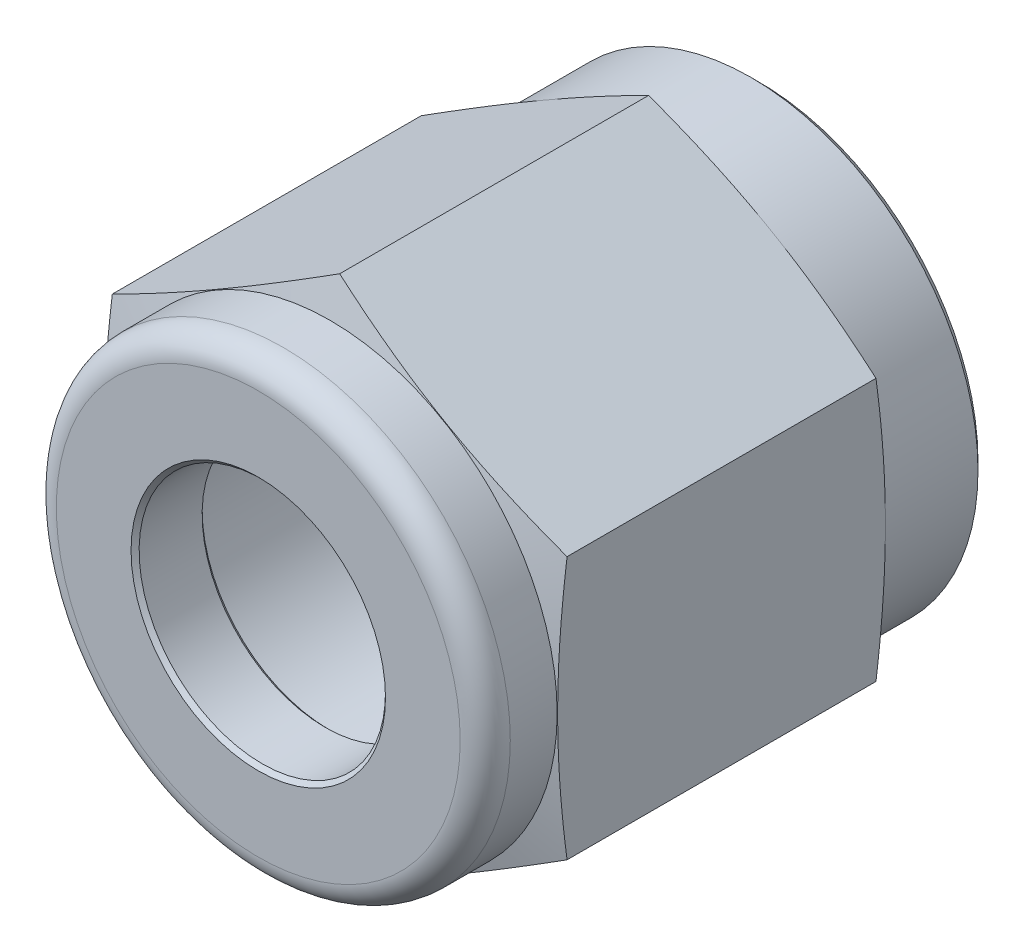
ISO-10303-21;
HEADER;
FILE_DESCRIPTION(('STEP AP214'),'2;1');
FILE_NAME('part.step','',(''),(''),'','','');
FILE_SCHEMA(('AUTOMOTIVE_DESIGN { 1 0 10303 214 1 1 1 1 }'));
ENDSEC;
DATA;
#1=APPLICATION_CONTEXT('core data for automotive mechanical design processes');
#2=APPLICATION_PROTOCOL_DEFINITION('international standard','automotive_design',2000,#1);
#3=PRODUCT_CONTEXT('',#1,'mechanical');
#4=PRODUCT('Part','Part','',(#3));
#5=PRODUCT_RELATED_PRODUCT_CATEGORY('part','',(#4));
#6=PRODUCT_DEFINITION_FORMATION('','',#4);
#7=PRODUCT_DEFINITION_CONTEXT('part definition',#1,'design');
#8=PRODUCT_DEFINITION('design','',#6,#7);
#9=PRODUCT_DEFINITION_SHAPE('','',#8);
#10=(LENGTH_UNIT() NAMED_UNIT(*) SI_UNIT(.MILLI.,.METRE.));
#11=(NAMED_UNIT(*) PLANE_ANGLE_UNIT() SI_UNIT($,.RADIAN.));
#12=(NAMED_UNIT(*) SI_UNIT($,.STERADIAN.) SOLID_ANGLE_UNIT());
#13=UNCERTAINTY_MEASURE_WITH_UNIT(LENGTH_MEASURE(1.E-05),#10,'distance_accuracy_value','');
#14=(GEOMETRIC_REPRESENTATION_CONTEXT(3) GLOBAL_UNCERTAINTY_ASSIGNED_CONTEXT((#13)) GLOBAL_UNIT_ASSIGNED_CONTEXT((#10,
#11,#12)) REPRESENTATION_CONTEXT('',''));
#15=CARTESIAN_POINT('',(0.,0.,0.));
#16=DIRECTION('',(0.,0.,1.));
#17=DIRECTION('',(1.,0.,0.));
#18=AXIS2_PLACEMENT_3D('',#15,#16,#17);
#19=CARTESIAN_POINT('',(0.,8.25622431946549,0.));
#20=DIRECTION('',(0.,0.,1.));
#21=DIRECTION('',(1.,0.,0.));
#22=AXIS2_PLACEMENT_3D('',#19,#20,#21);
#23=PLANE('',#22);
#24=CARTESIAN_POINT('',(0.,0.,0.));
#25=DIRECTION('',(0.,0.,1.));
#26=DIRECTION('',(1.,0.,0.));
#27=AXIS2_PLACEMENT_3D('',#24,#25,#26);
#28=CIRCLE('',#27,6.88339999999999);
#29=CARTESIAN_POINT('',(6.88339999999999,0.,0.));
#30=VERTEX_POINT('',#29);
#31=EDGE_CURVE('E273',#30,#30,#28,.F.);
#32=ORIENTED_EDGE('',*,*,#31,.T.);
#33=EDGE_LOOP('',(#32));
#34=FACE_BOUND('',#33,.T.);
#35=CARTESIAN_POINT('',(0.,0.,0.));
#36=DIRECTION('',(0.,0.,-1.));
#37=DIRECTION('',(0.,1.,0.));
#38=AXIS2_PLACEMENT_3D('',#35,#36,#37);
#39=CIRCLE('',#38,4.78291637771435);
#40=CARTESIAN_POINT('',(0.,4.78291637771435,0.));
#41=VERTEX_POINT('',#40);
#42=EDGE_CURVE('E242',#41,#41,#39,.T.);
#43=ORIENTED_EDGE('',*,*,#42,.F.);
#44=EDGE_LOOP('',(#43));
#45=FACE_BOUND('',#44,.T.);
#46=ADVANCED_FACE('F41',(#34,#45),#23,.F.);
#47=CARTESIAN_POINT('',(0.,0.,0.));
#48=DIRECTION('',(0.,0.,-1.));
#49=DIRECTION('',(0.,1.,0.));
#50=AXIS2_PLACEMENT_3D('',#47,#48,#49);
#51=CYLINDRICAL_SURFACE('',#50,7.1374);
#52=CARTESIAN_POINT('',(0.,0.,0.254000000000007));
#53=DIRECTION('',(0.,0.,1.));
#54=DIRECTION('',(0.,-1.,0.));
#55=AXIS2_PLACEMENT_3D('',#52,#53,#54);
#56=CIRCLE('',#55,7.1374);
#57=CARTESIAN_POINT('',(0.,-7.1374,0.254000000000006));
#58=VERTEX_POINT('',#57);
#59=EDGE_CURVE('E277',#58,#58,#56,.T.);
#60=ORIENTED_EDGE('',*,*,#59,.T.);
#61=EDGE_LOOP('',(#60));
#62=FACE_BOUND('',#61,.T.);
#63=CARTESIAN_POINT('',(0.,0.,3.175));
#64=DIRECTION('',(0.,0.,-1.));
#65=DIRECTION('',(0.,1.,0.));
#66=AXIS2_PLACEMENT_3D('',#63,#64,#65);
#67=CIRCLE('',#66,7.1374);
#68=CARTESIAN_POINT('',(0.,7.1374,3.175));
#69=VERTEX_POINT('',#68);
#70=EDGE_CURVE('E230',#69,#69,#67,.T.);
#71=ORIENTED_EDGE('',*,*,#70,.T.);
#72=EDGE_LOOP('',(#71));
#73=FACE_BOUND('',#72,.T.);
#74=ADVANCED_FACE('F141',(#62,#73),#51,.T.);
#75=CARTESIAN_POINT('',(0.,0.,3.47478807287307));
#76=DIRECTION('',(0.,0.,1.));
#77=DIRECTION('',(0.,-1.,0.));
#78=AXIS2_PLACEMENT_3D('',#75,#76,#77);
#79=CONICAL_SURFACE('',#78,8.25622431946549,1.30899693899575);
#80=ORIENTED_EDGE('',*,*,#70,.F.);
#81=EDGE_LOOP('',(#80));
#82=FACE_BOUND('',#81,.T.);
#83=CARTESIAN_POINT('',(7.1501,-10.9138828398678,4.75860151542387));
#84=CARTESIAN_POINT('',(7.1501,-10.5895769453141,4.68593353797852));
#85=CARTESIAN_POINT('',(7.1501,-10.2650680273871,4.61415538239005));
#86=CARTESIAN_POINT('',(7.1501,-9.61554445132473,4.47285900938083));
#87=CARTESIAN_POINT('',(7.1501,-9.29052977193818,4.40334088976508));
#88=CARTESIAN_POINT('',(7.1501,-8.63960294263009,4.26698420272897));
#89=CARTESIAN_POINT('',(7.1501,-8.31369022433024,4.20014833891397));
#90=CARTESIAN_POINT('',(7.1501,-7.66118595771361,4.06987862293135));
#91=CARTESIAN_POINT('',(7.1501,-7.33459441516394,4.00644474198301));
#92=CARTESIAN_POINT('',(7.1501,-6.68322136510452,3.88427824027479));
#93=CARTESIAN_POINT('',(7.1501,-6.3584461559822,3.82551220270828));
#94=CARTESIAN_POINT('',(7.1501,-5.70800949079891,3.71311782777684));
#95=CARTESIAN_POINT('',(7.1501,-5.38234805443124,3.65948937719041));
#96=CARTESIAN_POINT('',(7.1501,-4.73007647747673,3.55857904077149));
#97=CARTESIAN_POINT('',(7.1501,-4.40346646054479,3.51129636258905));
#98=CARTESIAN_POINT('',(7.1501,-3.74920730598459,3.42447209387384));
#99=CARTESIAN_POINT('',(7.1501,-3.42155816742004,3.38493051031814));
#100=CARTESIAN_POINT('',(7.1501,-2.76152687678763,3.31470950062921));
#101=CARTESIAN_POINT('',(7.1501,-2.42913328445532,3.28413600874202));
#102=CARTESIAN_POINT('',(7.1501,-1.76351186555912,3.23396118681777));
#103=CARTESIAN_POINT('',(7.1501,-1.43028405830245,3.21435960516025));
#104=CARTESIAN_POINT('',(7.1501,-0.763477429194141,3.18727191792475));
#105=CARTESIAN_POINT('',(7.1501,-0.429898834629788,3.17978032997945));
#106=CARTESIAN_POINT('',(7.1501,0.237304404669708,3.17737307413878));
#107=CARTESIAN_POINT('',(7.1501,0.570929049369216,3.1824573965662));
#108=CARTESIAN_POINT('',(7.1501,1.23897011925806,3.20491601919626));
#109=CARTESIAN_POINT('',(7.1501,1.57338501416503,3.22233492739003));
#110=CARTESIAN_POINT('',(7.1501,2.24142747986446,3.26846906294717));
#111=CARTESIAN_POINT('',(7.1501,2.57505503309474,3.29718453993661));
#112=CARTESIAN_POINT('',(7.1501,3.24152020478241,3.36446292134966));
#113=CARTESIAN_POINT('',(7.1501,3.57435716585659,3.40303223824729));
#114=CARTESIAN_POINT('',(7.1501,4.23896018219755,3.48841538968918));
#115=CARTESIAN_POINT('',(7.1501,4.5707262341084,3.53522925004388));
#116=CARTESIAN_POINT('',(7.1501,5.21100647270475,3.63223991881821));
#117=CARTESIAN_POINT('',(7.15009999999999,5.51958762732812,3.68199919010589));
#118=CARTESIAN_POINT('',(7.15009999999999,6.13593768218003,3.78633917810774));
#119=CARTESIAN_POINT('',(7.15009999999999,6.44370656011541,3.840920025763));
#120=CARTESIAN_POINT('',(7.15009999999999,7.05854436625168,3.95402195375594));
#121=CARTESIAN_POINT('',(7.15009999999999,7.36561322948537,4.0125433855596));
#122=CARTESIAN_POINT('',(7.15009999999999,7.97912096047287,4.13280787737556));
#123=CARTESIAN_POINT('',(7.15009999999999,8.28555982003552,4.19455097900331));
#124=CARTESIAN_POINT('',(7.15009999999999,9.20420130280969,4.38373831827979));
#125=CARTESIAN_POINT('',(7.15009999999999,9.8155932174319,4.51511507330491));
#126=CARTESIAN_POINT('',(7.15009999999999,11.0367521079976,4.78497858913828));
#127=CARTESIAN_POINT('',(7.15009999999999,11.6465191763972,4.923464935903));
#128=CARTESIAN_POINT('',(7.15009999999999,12.8589027680631,5.20406216254));
#129=CARTESIAN_POINT('',(7.15009999999999,13.4615306645536,5.3461240373558));
#130=CARTESIAN_POINT('',(7.15009999999999,14.6659456190864,5.63380550214537));
#131=CARTESIAN_POINT('',(7.15009999999999,15.2677326616641,5.77942515666527));
#132=CARTESIAN_POINT('',(7.15009999999999,16.4699234495495,6.07311302859643));
#133=CARTESIAN_POINT('',(7.15009999999999,17.0703279858856,6.22117801444107));
#134=CARTESIAN_POINT('',(7.15009999999999,18.2706138615976,6.51933121206419));
#135=CARTESIAN_POINT('',(7.15009999999999,18.8704952175481,6.66941935707092));
#136=CARTESIAN_POINT('',(7.15009999999999,19.4701941525164,6.82022419671362));
#137=B_SPLINE_CURVE_WITH_KNOTS('',3,(#83,#84,#85,#86,#87,#88,#89,#90,#91,#92,#93,#94,#95,#96,
#97,#98,#99,#100,#101,#102,#103,#104,#105,#106,#107,#108,#109,#110,#111,#112,#113,#114,#115,
#116,#117,#118,#119,#120,#121,#122,#123,#124,#125,#126,#127,#128,#129,#130,#131,#132,#133,#134,
#135,#136),.UNSPECIFIED.,.F.,.F.,(4,2,2,2,2,2,2,2,2,2,2,2,2,2,2,2,2,2,2,2,2,2,2,2,2,2,4),(0.,
0.997046960858289,1.99413701250312,2.9922080643413,3.99027067118493,4.98038490126997,
5.97047730631967,6.96044597056545,7.95041552706989,8.9516470921889,9.95285569497361,
10.9536109092371,11.9543653534154,12.9587576300209,13.9631721024439,14.9682418788671,
15.9733148018248,16.9109716545956,17.8486539794465,18.7864200485021,19.7241982340131,
21.6001685185764,23.4760296753264,25.3334528568964,27.1909097613661,29.0460823073238,
30.9011937748789),.UNSPECIFIED.);
#138=CARTESIAN_POINT('',(7.1501,-4.12811215973275,3.47478807287307));
#139=VERTEX_POINT('',#138);
#140=CARTESIAN_POINT('',(7.1501,4.12811215973275,3.47478807287307));
#141=VERTEX_POINT('',#140);
#142=EDGE_CURVE('E113',#139,#141,#137,.T.);
#143=ORIENTED_EDGE('',*,*,#142,.F.);
#144=CARTESIAN_POINT('',(-0.000199999999988828,-8.25633978951932,3.47481901362982));
#145=CARTESIAN_POINT('',(0.296742266660478,-8.08490009192912,3.42886257681858));
#146=CARTESIAN_POINT('',(0.594222923002725,-7.91314955491122,3.38714171766773));
#147=CARTESIAN_POINT('',(1.19023480972998,-7.56904193166902,3.31384208241379));
#148=CARTESIAN_POINT('',(1.48876641720988,-7.39668462772889,3.2822674258099));
#149=CARTESIAN_POINT('',(2.08507021110049,-7.05240847180735,3.23110350009016));
#150=CARTESIAN_POINT('',(2.38283836532122,-6.88049194781191,3.21145321592267));
#151=CARTESIAN_POINT('',(2.97875440278981,-6.536439663165,3.1851041961545));
#152=CARTESIAN_POINT('',(3.27690220139491,-6.36430395138206,3.17840295474387));
#153=CARTESIAN_POINT('',(3.8731977986051,-6.02003252781616,3.17840295474387));
#154=CARTESIAN_POINT('',(4.17134559721019,-5.84789681603322,3.1851041961545));
#155=CARTESIAN_POINT('',(4.76726163467879,-5.50384453138631,3.21145321592267));
#156=CARTESIAN_POINT('',(5.06502978889951,-5.33192800739088,3.23110350009016));
#157=CARTESIAN_POINT('',(5.66133358279013,-4.98765185146934,3.2822674258099));
#158=CARTESIAN_POINT('',(5.95986519027003,-4.8152945475292,3.31384208241379));
#159=CARTESIAN_POINT('',(6.55587707699728,-4.471186924287,3.38714171766773));
#160=CARTESIAN_POINT('',(6.85335773333953,-4.2994363872691,3.42886257681858));
#161=CARTESIAN_POINT('',(7.1503,-4.1279966896789,3.47481901362982));
#162=B_SPLINE_CURVE_WITH_KNOTS('',3,(#144,#145,#146,#147,#148,#149,#150,#151,#152,#153,#154,
#155,#156,#157,#158,#159,#160,#161),.UNSPECIFIED.,.F.,.F.,(4,2,2,2,2,2,2,2,4),(0.,
1.0378908111893,2.07620248958682,3.10915548710712,4.14190857462195,5.17466166213679,
6.20761465965709,7.24592633805461,8.28381714924391),.UNSPECIFIED.);
#163=CARTESIAN_POINT('',(0.,-8.25622431946549,3.47478807287307));
#164=VERTEX_POINT('',#163);
#165=EDGE_CURVE('E152',#164,#139,#162,.T.);
#166=ORIENTED_EDGE('',*,*,#165,.F.);
#167=CARTESIAN_POINT('',(-7.1503,-4.1279966896789,3.47481901362982));
#168=CARTESIAN_POINT('',(-6.85335773333953,-4.2994363872691,3.42886257681858));
#169=CARTESIAN_POINT('',(-6.55587707699728,-4.471186924287,3.38714171766773));
#170=CARTESIAN_POINT('',(-5.95986519027002,-4.8152945475292,3.31384208241379));
#171=CARTESIAN_POINT('',(-5.66133358279012,-4.98765185146934,3.2822674258099));
#172=CARTESIAN_POINT('',(-5.06502978889951,-5.33192800739088,3.23110350009016));
#173=CARTESIAN_POINT('',(-4.76726163467878,-5.50384453138631,3.21145321592267));
#174=CARTESIAN_POINT('',(-4.17134559721019,-5.84789681603322,3.1851041961545));
#175=CARTESIAN_POINT('',(-3.87319779860509,-6.02003252781616,3.17840295474387));
#176=CARTESIAN_POINT('',(-3.2769022013949,-6.36430395138206,3.17840295474387));
#177=CARTESIAN_POINT('',(-2.9787544027898,-6.536439663165,3.1851041961545));
#178=CARTESIAN_POINT('',(-2.3828383653212,-6.88049194781191,3.21145321592267));
#179=CARTESIAN_POINT('',(-2.08507021110048,-7.05240847180735,3.23110350009016));
#180=CARTESIAN_POINT('',(-1.48876641720987,-7.39668462772889,3.2822674258099));
#181=CARTESIAN_POINT('',(-1.19023480972996,-7.56904193166902,3.31384208241379));
#182=CARTESIAN_POINT('',(-0.594222923002706,-7.91314955491122,3.38714171766773));
#183=CARTESIAN_POINT('',(-0.296742266660458,-8.08490009192912,3.42886257681858));
#184=CARTESIAN_POINT('',(0.000200000000009483,-8.25633978951932,3.47481901362982));
#185=B_SPLINE_CURVE_WITH_KNOTS('',3,(#167,#168,#169,#170,#171,#172,#173,#174,#175,#176,#177,
#178,#179,#180,#181,#182,#183,#184),.UNSPECIFIED.,.F.,.F.,(4,2,2,2,2,2,2,2,4),(0.,
1.0378908111893,2.07620248958683,3.10915548710713,4.14190857462196,5.1746616621368,
6.2076146596571,7.24592633805462,8.28381714924392),.UNSPECIFIED.);
#186=CARTESIAN_POINT('',(-7.15010000000001,-4.12811215973273,3.47478807287307));
#187=VERTEX_POINT('',#186);
#188=EDGE_CURVE('E160',#187,#164,#185,.T.);
#189=ORIENTED_EDGE('',*,*,#188,.F.);
#190=CARTESIAN_POINT('',(-7.15009999999999,-10.9138828398678,4.75860151542387));
#191=CARTESIAN_POINT('',(-7.15009999999999,-10.5895769453141,4.68593353797852));
#192=CARTESIAN_POINT('',(-7.15009999999999,-10.2650680273871,4.61415538239005));
#193=CARTESIAN_POINT('',(-7.15009999999999,-9.61554445132474,4.47285900938083));
#194=CARTESIAN_POINT('',(-7.15009999999999,-9.29052977193818,4.40334088976508));
#195=CARTESIAN_POINT('',(-7.15009999999999,-8.63960294263009,4.26698420272897));
#196=CARTESIAN_POINT('',(-7.15009999999999,-8.31369022433025,4.20014833891397));
#197=CARTESIAN_POINT('',(-7.15009999999999,-7.66118595771361,4.06987862293135));
#198=CARTESIAN_POINT('',(-7.15009999999999,-7.33459441516395,4.00644474198301));
#199=CARTESIAN_POINT('',(-7.15009999999999,-6.68322136510452,3.88427824027479));
#200=CARTESIAN_POINT('',(-7.15009999999999,-6.3584461559822,3.82551220270828));
#201=CARTESIAN_POINT('',(-7.15009999999999,-5.70800949079891,3.71311782777684));
#202=CARTESIAN_POINT('',(-7.15009999999999,-5.38234805443124,3.65948937719041));
#203=CARTESIAN_POINT('',(-7.15009999999999,-4.73007647747673,3.55857904077149));
#204=CARTESIAN_POINT('',(-7.1501,-4.40346646054479,3.51129636258905));
#205=CARTESIAN_POINT('',(-7.1501,-3.7492073059846,3.42447209387384));
#206=CARTESIAN_POINT('',(-7.1501,-3.42155816742005,3.38493051031814));
#207=CARTESIAN_POINT('',(-7.1501,-2.76152687678764,3.31470950062921));
#208=CARTESIAN_POINT('',(-7.1501,-2.42913328445533,3.28413600874202));
#209=CARTESIAN_POINT('',(-7.1501,-1.76351186555912,3.23396118681777));
#210=CARTESIAN_POINT('',(-7.1501,-1.43028405830246,3.21435960516025));
#211=CARTESIAN_POINT('',(-7.1501,-0.763477429194147,3.18727191792475));
#212=CARTESIAN_POINT('',(-7.1501,-0.429898834629794,3.17978032997945));
#213=CARTESIAN_POINT('',(-7.1501,0.237304404669702,3.17737307413878));
#214=CARTESIAN_POINT('',(-7.1501,0.57092904936921,3.1824573965662));
#215=CARTESIAN_POINT('',(-7.1501,1.23897011925806,3.20491601919626));
#216=CARTESIAN_POINT('',(-7.1501,1.57338501416502,3.22233492739003));
#217=CARTESIAN_POINT('',(-7.1501,2.24142747986446,3.26846906294717));
#218=CARTESIAN_POINT('',(-7.1501,2.57505503309474,3.29718453993661));
#219=CARTESIAN_POINT('',(-7.1501,3.2415202047824,3.36446292134967));
#220=CARTESIAN_POINT('',(-7.1501,3.57435716585659,3.40303223824729));
#221=CARTESIAN_POINT('',(-7.1501,4.23896018219754,3.48841538968918));
#222=CARTESIAN_POINT('',(-7.1501,4.5707262341084,3.53522925004388));
#223=CARTESIAN_POINT('',(-7.1501,5.21100647270474,3.63223991881821));
#224=CARTESIAN_POINT('',(-7.1501,5.51958762732811,3.68199919010589));
#225=CARTESIAN_POINT('',(-7.1501,6.13593768218002,3.78633917810774));
#226=CARTESIAN_POINT('',(-7.15010000000001,6.4437065601154,3.840920025763));
#227=CARTESIAN_POINT('',(-7.15010000000001,7.05854436625167,3.95402195375594));
#228=CARTESIAN_POINT('',(-7.15010000000001,7.36561322948536,4.0125433855596));
#229=CARTESIAN_POINT('',(-7.15010000000001,7.97912096047286,4.13280787737556));
#230=CARTESIAN_POINT('',(-7.15010000000001,8.28555982003552,4.19455097900331));
#231=CARTESIAN_POINT('',(-7.15010000000001,9.20420130280969,4.38373831827979));
#232=CARTESIAN_POINT('',(-7.15010000000001,9.81559321743189,4.51511507330491));
#233=CARTESIAN_POINT('',(-7.15010000000001,11.0367521079976,4.78497858913828));
#234=CARTESIAN_POINT('',(-7.15010000000001,11.6465191763972,4.923464935903));
#235=CARTESIAN_POINT('',(-7.15010000000001,12.8589027680631,5.20406216254));
#236=CARTESIAN_POINT('',(-7.15010000000001,13.4615306645536,5.3461240373558));
#237=CARTESIAN_POINT('',(-7.15010000000001,14.6659456190864,5.63380550214537));
#238=CARTESIAN_POINT('',(-7.15010000000001,15.267732661664,5.77942515666527));
#239=CARTESIAN_POINT('',(-7.15010000000001,16.4699234495495,6.07311302859643));
#240=CARTESIAN_POINT('',(-7.15010000000001,17.0703279858856,6.22117801444107));
#241=CARTESIAN_POINT('',(-7.15010000000002,18.2706138615976,6.51933121206419));
#242=CARTESIAN_POINT('',(-7.15010000000002,18.8704952175481,6.66941935707092));
#243=CARTESIAN_POINT('',(-7.15010000000002,19.4701941525164,6.82022419671361));
#244=B_SPLINE_CURVE_WITH_KNOTS('',3,(#190,#191,#192,#193,#194,#195,#196,#197,#198,#199,#200,
#201,#202,#203,#204,#205,#206,#207,#208,#209,#210,#211,#212,#213,#214,#215,#216,#217,#218,#219,
#220,#221,#222,#223,#224,#225,#226,#227,#228,#229,#230,#231,#232,#233,#234,#235,#236,#237,#238,
#239,#240,#241,#242,#243),.UNSPECIFIED.,.F.,.F.,(4,2,2,2,2,2,2,2,2,2,2,2,2,2,2,2,2,2,2,2,2,2,2,
2,2,2,4),(0.,0.997046960858289,1.99413701250312,2.9922080643413,3.99027067118493,
4.98038490126997,5.97047730631967,6.96044597056545,7.95041552706989,8.9516470921889,
9.95285569497361,10.9536109092371,11.9543653534154,12.9587576300209,13.9631721024439,
14.9682418788671,15.9733148018248,16.9109716545956,17.8486539794465,18.7864200485021,
19.7241982340131,21.6001685185764,23.4760296753264,25.3334528568964,27.1909097613661,
29.0460823073238,30.9011937748789),.UNSPECIFIED.);
#245=CARTESIAN_POINT('',(-7.1501,4.12811215973274,3.47478807287307));
#246=VERTEX_POINT('',#245);
#247=EDGE_CURVE('E95',#246,#187,#244,.F.);
#248=ORIENTED_EDGE('',*,*,#247,.F.);
#249=CARTESIAN_POINT('',(0.000200000000000074,8.25633978951933,3.47481901362982));
#250=CARTESIAN_POINT('',(-0.296742266660467,8.08490009192913,3.42886257681859));
#251=CARTESIAN_POINT('',(-0.594222923002715,7.91314955491122,3.38714171766774));
#252=CARTESIAN_POINT('',(-1.19023480972997,7.56904193166902,3.31384208241379));
#253=CARTESIAN_POINT('',(-1.48876641720987,7.39668462772889,3.2822674258099));
#254=CARTESIAN_POINT('',(-2.08507021110049,7.05240847180735,3.23110350009017));
#255=CARTESIAN_POINT('',(-2.38283836532121,6.88049194781192,3.21145321592267));
#256=CARTESIAN_POINT('',(-2.97875440278981,6.53643966316501,3.1851041961545));
#257=CARTESIAN_POINT('',(-3.2769022013949,6.36430395138206,3.17840295474388));
#258=CARTESIAN_POINT('',(-3.8731977986051,6.02003252781617,3.17840295474388));
#259=CARTESIAN_POINT('',(-4.17134559721019,5.84789681603322,3.1851041961545));
#260=CARTESIAN_POINT('',(-4.76726163467879,5.50384453138631,3.21145321592267));
#261=CARTESIAN_POINT('',(-5.06502978889952,5.33192800739088,3.23110350009017));
#262=CARTESIAN_POINT('',(-5.66133358279013,4.98765185146934,3.2822674258099));
#263=CARTESIAN_POINT('',(-5.95986519027003,4.81529454752921,3.31384208241379));
#264=CARTESIAN_POINT('',(-6.55587707699729,4.47118692428701,3.38714171766774));
#265=CARTESIAN_POINT('',(-6.85335773333953,4.2994363872691,3.42886257681859));
#266=CARTESIAN_POINT('',(-7.1503,4.12799668967891,3.47481901362982));
#267=B_SPLINE_CURVE_WITH_KNOTS('',3,(#249,#250,#251,#252,#253,#254,#255,#256,#257,#258,#259,
#260,#261,#262,#263,#264,#265,#266),.UNSPECIFIED.,.F.,.F.,(4,2,2,2,2,2,2,2,4),(0.,
1.0378908111893,2.07620248958682,3.10915548710713,4.14190857462196,5.1746616621368,
6.2076146596571,7.24592633805462,8.28381714924392),.UNSPECIFIED.);
#268=CARTESIAN_POINT('',(0.,8.25622431946549,3.47478807287307));
#269=VERTEX_POINT('',#268);
#270=EDGE_CURVE('E92',#269,#246,#267,.T.);
#271=ORIENTED_EDGE('',*,*,#270,.F.);
#272=CARTESIAN_POINT('',(7.1503,4.12799668967892,3.47481901362982));
#273=CARTESIAN_POINT('',(6.85335773333953,4.29943638726911,3.42886257681859));
#274=CARTESIAN_POINT('',(6.55587707699728,4.47118692428702,3.38714171766774));
#275=CARTESIAN_POINT('',(5.95986519027002,4.81529454752921,3.31384208241379));
#276=CARTESIAN_POINT('',(5.66133358279012,4.98765185146935,3.2822674258099));
#277=CARTESIAN_POINT('',(5.06502978889951,5.33192800739089,3.23110350009017));
#278=CARTESIAN_POINT('',(4.76726163467879,5.50384453138632,3.21145321592267));
#279=CARTESIAN_POINT('',(4.17134559721019,5.84789681603323,3.1851041961545));
#280=CARTESIAN_POINT('',(3.87319779860509,6.02003252781618,3.17840295474388));
#281=CARTESIAN_POINT('',(3.2769022013949,6.36430395138207,3.17840295474388));
#282=CARTESIAN_POINT('',(2.97875440278981,6.53643966316501,3.1851041961545));
#283=CARTESIAN_POINT('',(2.38283836532121,6.88049194781192,3.21145321592267));
#284=CARTESIAN_POINT('',(2.08507021110049,7.05240847180736,3.23110350009017));
#285=CARTESIAN_POINT('',(1.48876641720987,7.39668462772889,3.2822674258099));
#286=CARTESIAN_POINT('',(1.19023480972997,7.56904193166903,3.31384208241379));
#287=CARTESIAN_POINT('',(0.594222923002716,7.91314955491122,3.38714171766774));
#288=CARTESIAN_POINT('',(0.296742266660468,8.08490009192913,3.42886257681859));
#289=CARTESIAN_POINT('',(-0.000199999999998477,8.25633978951933,3.47481901362982));
#290=B_SPLINE_CURVE_WITH_KNOTS('',3,(#272,#273,#274,#275,#276,#277,#278,#279,#280,#281,#282,
#283,#284,#285,#286,#287,#288,#289),.UNSPECIFIED.,.F.,.F.,(4,2,2,2,2,2,2,2,4),(0.,
1.0378908111893,2.07620248958682,3.10915548710712,4.14190857462196,5.17466166213679,
6.20761465965709,7.24592633805461,8.28381714924391),.UNSPECIFIED.);
#291=EDGE_CURVE('E64',#141,#269,#290,.T.);
#292=ORIENTED_EDGE('',*,*,#291,.F.);
#293=EDGE_LOOP('',(#143,#166,#189,#248,#271,#292));
#294=FACE_BOUND('',#293,.T.);
#295=ADVANCED_FACE('F93',(#82,#294),#79,.T.);
#296=CARTESIAN_POINT('',(7.1501,4.12811215973275,15.748));
#297=DIRECTION('',(-0.499999999999999,-0.866025403784439,0.));
#298=DIRECTION('',(0.866025403784439,-0.499999999999999,0.));
#299=AXIS2_PLACEMENT_3D('',#296,#297,#298);
#300=PLANE('',#299);
#301=DIRECTION('',(0.,0.,-1.));
#302=VECTOR('',#301,1.);
#303=CARTESIAN_POINT('',(0.,8.25622431946549,15.748));
#304=LINE('',#303,#302);
#305=CARTESIAN_POINT('',(0.,8.25622431946549,13.1876119271269));
#306=VERTEX_POINT('',#305);
#307=EDGE_CURVE('E106',#306,#269,#304,.T.);
#308=ORIENTED_EDGE('',*,*,#307,.F.);
#309=CARTESIAN_POINT('',(-0.0002,8.25633978951933,13.1875809863702));
#310=CARTESIAN_POINT('',(0.296742266660467,8.08490009192913,13.2335374231814));
#311=CARTESIAN_POINT('',(0.594222923002715,7.91314955491123,13.2752582823323));
#312=CARTESIAN_POINT('',(1.19023480972997,7.56904193166903,13.3485579175862));
#313=CARTESIAN_POINT('',(1.48876641720987,7.39668462772889,13.3801325741901));
#314=CARTESIAN_POINT('',(2.08507021110048,7.05240847180735,13.4312964999098));
#315=CARTESIAN_POINT('',(2.38283836532121,6.88049194781192,13.4509467840773));
#316=CARTESIAN_POINT('',(2.97875440278981,6.53643966316501,13.4772958038455));
#317=CARTESIAN_POINT('',(3.2769022013949,6.36430395138207,13.4839970452561));
#318=CARTESIAN_POINT('',(3.87319779860509,6.02003252781618,13.4839970452561));
#319=CARTESIAN_POINT('',(4.17134559721019,5.84789681603323,13.4772958038455));
#320=CARTESIAN_POINT('',(4.76726163467879,5.50384453138632,13.4509467840773));
#321=CARTESIAN_POINT('',(5.06502978889951,5.33192800739089,13.4312964999098));
#322=CARTESIAN_POINT('',(5.66133358279012,4.98765185146935,13.3801325741901));
#323=CARTESIAN_POINT('',(5.95986519027002,4.81529454752921,13.3485579175862));
#324=CARTESIAN_POINT('',(6.55587707699728,4.47118692428702,13.2752582823323));
#325=CARTESIAN_POINT('',(6.85335773333953,4.29943638726911,13.2335374231814));
#326=CARTESIAN_POINT('',(7.1503,4.12799668967892,13.1875809863702));
#327=B_SPLINE_CURVE_WITH_KNOTS('',3,(#309,#310,#311,#312,#313,#314,#315,#316,#317,#318,#319,
#320,#321,#322,#323,#324,#325,#326),.UNSPECIFIED.,.F.,.F.,(4,2,2,2,2,2,2,2,4),(0.,
1.0378908111893,2.07620248958682,3.10915548710712,4.14190857462196,5.17466166213679,
6.20761465965709,7.24592633805462,8.28381714924391),.UNSPECIFIED.);
#328=CARTESIAN_POINT('',(7.1501,4.12811215973275,13.1876119271269));
#329=VERTEX_POINT('',#328);
#330=EDGE_CURVE('E197',#306,#329,#327,.T.);
#331=ORIENTED_EDGE('',*,*,#330,.T.);
#332=DIRECTION('',(0.,0.,-1.));
#333=VECTOR('',#332,1.);
#334=CARTESIAN_POINT('',(7.1501,4.12811215973275,15.748));
#335=LINE('',#334,#333);
#336=EDGE_CURVE('E108',#329,#141,#335,.T.);
#337=ORIENTED_EDGE('',*,*,#336,.T.);
#338=ORIENTED_EDGE('',*,*,#291,.T.);
#339=EDGE_LOOP('',(#308,#331,#337,#338));
#340=FACE_BOUND('',#339,.T.);
#341=ADVANCED_FACE('F104',(#340),#300,.F.);
#342=CARTESIAN_POINT('',(0.,8.25622431946549,15.748));
#343=DIRECTION('',(0.5,-0.866025403784439,0.));
#344=DIRECTION('',(0.866025403784439,0.5,0.));
#345=AXIS2_PLACEMENT_3D('',#342,#343,#344);
#346=PLANE('',#345);
#347=DIRECTION('',(0.,0.,-1.));
#348=VECTOR('',#347,1.);
#349=CARTESIAN_POINT('',(-7.1501,4.12811215973274,15.748));
#350=LINE('',#349,#348);
#351=CARTESIAN_POINT('',(-7.1501,4.12811215973274,13.1876119271269));
#352=VERTEX_POINT('',#351);
#353=EDGE_CURVE('E114',#352,#246,#350,.T.);
#354=ORIENTED_EDGE('',*,*,#353,.F.);
#355=CARTESIAN_POINT('',(-7.1503,4.12799668967891,13.1875809863702));
#356=CARTESIAN_POINT('',(-6.85335773333954,4.2994363872691,13.2335374231814));
#357=CARTESIAN_POINT('',(-6.55587707699729,4.47118692428701,13.2752582823323));
#358=CARTESIAN_POINT('',(-5.95986519027003,4.81529454752921,13.3485579175862));
#359=CARTESIAN_POINT('',(-5.66133358279013,4.98765185146934,13.3801325741901));
#360=CARTESIAN_POINT('',(-5.06502978889952,5.33192800739088,13.4312964999098));
#361=CARTESIAN_POINT('',(-4.76726163467879,5.50384453138631,13.4509467840773));
#362=CARTESIAN_POINT('',(-4.17134559721019,5.84789681603322,13.4772958038455));
#363=CARTESIAN_POINT('',(-3.8731977986051,6.02003252781617,13.4839970452561));
#364=CARTESIAN_POINT('',(-3.27690220139491,6.36430395138206,13.4839970452561));
#365=CARTESIAN_POINT('',(-2.97875440278981,6.53643966316501,13.4772958038455));
#366=CARTESIAN_POINT('',(-2.38283836532121,6.88049194781192,13.4509467840773));
#367=CARTESIAN_POINT('',(-2.08507021110049,7.05240847180735,13.4312964999098));
#368=CARTESIAN_POINT('',(-1.48876641720988,7.39668462772889,13.3801325741901));
#369=CARTESIAN_POINT('',(-1.19023480972997,7.56904193166902,13.3485579175862));
#370=CARTESIAN_POINT('',(-0.594222923002716,7.91314955491122,13.2752582823323));
#371=CARTESIAN_POINT('',(-0.296742266660468,8.08490009192913,13.2335374231814));
#372=CARTESIAN_POINT('',(0.000199999999999177,8.25633978951933,13.1875809863702));
#373=B_SPLINE_CURVE_WITH_KNOTS('',3,(#355,#356,#357,#358,#359,#360,#361,#362,#363,#364,#365,
#366,#367,#368,#369,#370,#371,#372),.UNSPECIFIED.,.F.,.F.,(4,2,2,2,2,2,2,2,4),(0.,
1.0378908111893,2.07620248958682,3.10915548710713,4.14190857462196,5.1746616621368,
6.2076146596571,7.24592633805462,8.28381714924392),.UNSPECIFIED.);
#374=EDGE_CURVE('E112',#352,#306,#373,.T.);
#375=ORIENTED_EDGE('',*,*,#374,.T.);
#376=ORIENTED_EDGE('',*,*,#307,.T.);
#377=ORIENTED_EDGE('',*,*,#270,.T.);
#378=EDGE_LOOP('',(#354,#375,#376,#377));
#379=FACE_BOUND('',#378,.T.);
#380=ADVANCED_FACE('F111',(#379),#346,.F.);
#381=CARTESIAN_POINT('',(-7.1501,4.12811215973274,15.748));
#382=DIRECTION('',(1.,0.,0.));
#383=DIRECTION('',(0.,1.,0.));
#384=AXIS2_PLACEMENT_3D('',#381,#382,#383);
#385=PLANE('',#384);
#386=DIRECTION('',(0.,0.,-1.));
#387=VECTOR('',#386,1.);
#388=CARTESIAN_POINT('',(-7.1501,-4.12811215973274,15.748));
#389=LINE('',#388,#387);
#390=CARTESIAN_POINT('',(-7.15010000000001,-4.12811215973274,13.1876119271269));
#391=VERTEX_POINT('',#390);
#392=EDGE_CURVE('E118',#391,#187,#389,.T.);
#393=ORIENTED_EDGE('',*,*,#392,.F.);
#394=CARTESIAN_POINT('',(-7.15009999999999,-10.9138828398678,11.9037984845761));
#395=CARTESIAN_POINT('',(-7.15009999999999,-10.5895769453141,11.9764664620215));
#396=CARTESIAN_POINT('',(-7.15009999999999,-10.2650680273871,12.0482446176099));
#397=CARTESIAN_POINT('',(-7.15009999999999,-9.61554445132474,12.1895409906192));
#398=CARTESIAN_POINT('',(-7.15009999999999,-9.29052977193818,12.2590591102349));
#399=CARTESIAN_POINT('',(-7.15009999999999,-8.63960294263009,12.395415797271));
#400=CARTESIAN_POINT('',(-7.15009999999999,-8.31369022433025,12.462251661086));
#401=CARTESIAN_POINT('',(-7.15009999999999,-7.66118595771361,12.5925213770686));
#402=CARTESIAN_POINT('',(-7.15009999999999,-7.33459441516395,12.655955258017));
#403=CARTESIAN_POINT('',(-7.15009999999999,-6.68322136510452,12.7781217597252));
#404=CARTESIAN_POINT('',(-7.15009999999999,-6.3584461559822,12.8368877972917));
#405=CARTESIAN_POINT('',(-7.15009999999999,-5.70800949079891,12.9492821722232));
#406=CARTESIAN_POINT('',(-7.15009999999999,-5.38234805443124,13.0029106228096));
#407=CARTESIAN_POINT('',(-7.15009999999999,-4.73007647747673,13.1038209592285));
#408=CARTESIAN_POINT('',(-7.1501,-4.40346646054479,13.1511036374109));
#409=CARTESIAN_POINT('',(-7.1501,-3.7492073059846,13.2379279061262));
#410=CARTESIAN_POINT('',(-7.1501,-3.42155816742005,13.2774694896819));
#411=CARTESIAN_POINT('',(-7.1501,-2.76152687678764,13.3476904993708));
#412=CARTESIAN_POINT('',(-7.1501,-2.42913328445533,13.378263991258));
#413=CARTESIAN_POINT('',(-7.1501,-1.76351186555912,13.4284388131822));
#414=CARTESIAN_POINT('',(-7.1501,-1.43028405830246,13.4480403948397));
#415=CARTESIAN_POINT('',(-7.1501,-0.763477429194146,13.4751280820752));
#416=CARTESIAN_POINT('',(-7.1501,-0.429898834629792,13.4826196700206));
#417=CARTESIAN_POINT('',(-7.1501,0.237304404669703,13.4850269258612));
#418=CARTESIAN_POINT('',(-7.1501,0.570929049369213,13.4799426034338));
#419=CARTESIAN_POINT('',(-7.1501,1.23897011925806,13.4574839808037));
#420=CARTESIAN_POINT('',(-7.1501,1.57338501416502,13.44006507261));
#421=CARTESIAN_POINT('',(-7.1501,2.24142747986446,13.3939309370528));
#422=CARTESIAN_POINT('',(-7.1501,2.57505503309474,13.3652154600634));
#423=CARTESIAN_POINT('',(-7.1501,3.2415202047824,13.2979370786503));
#424=CARTESIAN_POINT('',(-7.1501,3.57435716585659,13.2593677617527));
#425=CARTESIAN_POINT('',(-7.1501,4.23896018219754,13.1739846103108));
#426=CARTESIAN_POINT('',(-7.1501,4.5707262341084,13.1271707499561));
#427=CARTESIAN_POINT('',(-7.1501,5.21100647270475,13.0301600811818));
#428=CARTESIAN_POINT('',(-7.1501,5.51958762732812,12.9804008098941));
#429=CARTESIAN_POINT('',(-7.1501,6.13593768218003,12.8760608218923));
#430=CARTESIAN_POINT('',(-7.15010000000001,6.44370656011541,12.821479974237));
#431=CARTESIAN_POINT('',(-7.15010000000001,7.05854436625168,12.7083780462441));
#432=CARTESIAN_POINT('',(-7.15010000000001,7.36561322948537,12.6498566144404));
#433=CARTESIAN_POINT('',(-7.15010000000001,7.97912096047287,12.5295921226244));
#434=CARTESIAN_POINT('',(-7.15010000000001,8.28555982003552,12.4678490209967));
#435=CARTESIAN_POINT('',(-7.15010000000001,9.20420130280969,12.2786616817202));
#436=CARTESIAN_POINT('',(-7.15010000000001,9.8155932174319,12.1472849266951));
#437=CARTESIAN_POINT('',(-7.15010000000001,11.0367521079976,11.8774214108617));
#438=CARTESIAN_POINT('',(-7.15010000000001,11.6465191763972,11.738935064097));
#439=CARTESIAN_POINT('',(-7.15010000000001,12.8589027680631,11.45833783746));
#440=CARTESIAN_POINT('',(-7.15010000000001,13.4615306645536,11.3162759626442));
#441=CARTESIAN_POINT('',(-7.15010000000001,14.6659456190864,11.0285944978546));
#442=CARTESIAN_POINT('',(-7.15010000000001,15.267732661664,10.8829748433347));
#443=CARTESIAN_POINT('',(-7.15010000000001,16.4699234495495,10.5892869714036));
#444=CARTESIAN_POINT('',(-7.15010000000001,17.0703279858856,10.4412219855589));
#445=CARTESIAN_POINT('',(-7.15010000000002,18.2706138615976,10.1430687879358));
#446=CARTESIAN_POINT('',(-7.15010000000002,18.8704952175481,9.99298064292908));
#447=CARTESIAN_POINT('',(-7.15010000000002,19.4701941525164,9.84217580328638));
#448=B_SPLINE_CURVE_WITH_KNOTS('',3,(#394,#395,#396,#397,#398,#399,#400,#401,#402,#403,#404,
#405,#406,#407,#408,#409,#410,#411,#412,#413,#414,#415,#416,#417,#418,#419,#420,#421,#422,#423,
#424,#425,#426,#427,#428,#429,#430,#431,#432,#433,#434,#435,#436,#437,#438,#439,#440,#441,#442,
#443,#444,#445,#446,#447),.UNSPECIFIED.,.F.,.F.,(4,2,2,2,2,2,2,2,2,2,2,2,2,2,2,2,2,2,2,2,2,2,2,
2,2,2,4),(0.,0.997046960858291,1.99413701250312,2.9922080643413,3.99027067118493,
4.98038490126997,5.97047730631967,6.96044597056546,7.95041552706989,8.9516470921889,
9.95285569497362,10.9536109092371,11.9543653534154,12.9587576300209,13.9631721024439,
14.9682418788671,15.9733148018248,16.9109716545956,17.8486539794465,18.7864200485021,
19.7241982340131,21.6001685185764,23.4760296753264,25.3334528568964,27.1909097613661,
29.0460823073238,30.9011937748789),.UNSPECIFIED.);
#449=EDGE_CURVE('E198',#391,#352,#448,.T.);
#450=ORIENTED_EDGE('',*,*,#449,.T.);
#451=ORIENTED_EDGE('',*,*,#353,.T.);
#452=ORIENTED_EDGE('',*,*,#247,.T.);
#453=EDGE_LOOP('',(#393,#450,#451,#452));
#454=FACE_BOUND('',#453,.T.);
#455=ADVANCED_FACE('F185',(#454),#385,.F.);
#456=CARTESIAN_POINT('',(-7.1501,-4.12811215973274,15.748));
#457=DIRECTION('',(0.5,0.866025403784439,0.));
#458=DIRECTION('',(-0.866025403784439,0.499999999999999,0.));
#459=AXIS2_PLACEMENT_3D('',#456,#457,#458);
#460=PLANE('',#459);
#461=DIRECTION('',(0.,0.,-1.));
#462=VECTOR('',#461,1.);
#463=CARTESIAN_POINT('',(0.,-8.25622431946548,15.748));
#464=LINE('',#463,#462);
#465=CARTESIAN_POINT('',(0.,-8.25622431946549,13.1876119271269));
#466=VERTEX_POINT('',#465);
#467=EDGE_CURVE('E213',#466,#164,#464,.T.);
#468=ORIENTED_EDGE('',*,*,#467,.F.);
#469=CARTESIAN_POINT('',(0.000200000000011247,-8.25633978951932,13.1875809863702));
#470=CARTESIAN_POINT('',(-0.296742266660456,-8.08490009192912,13.2335374231814));
#471=CARTESIAN_POINT('',(-0.594222923002704,-7.91314955491122,13.2752582823323));
#472=CARTESIAN_POINT('',(-1.19023480972996,-7.56904193166902,13.3485579175862));
#473=CARTESIAN_POINT('',(-1.48876641720986,-7.39668462772889,13.3801325741901));
#474=CARTESIAN_POINT('',(-2.08507021110048,-7.05240847180735,13.4312964999098));
#475=CARTESIAN_POINT('',(-2.3828383653212,-6.88049194781191,13.4509467840773));
#476=CARTESIAN_POINT('',(-2.9787544027898,-6.536439663165,13.4772958038455));
#477=CARTESIAN_POINT('',(-3.2769022013949,-6.36430395138206,13.4839970452561));
#478=CARTESIAN_POINT('',(-3.87319779860509,-6.02003252781616,13.4839970452561));
#479=CARTESIAN_POINT('',(-4.17134559721018,-5.84789681603322,13.4772958038455));
#480=CARTESIAN_POINT('',(-4.76726163467878,-5.50384453138631,13.4509467840773));
#481=CARTESIAN_POINT('',(-5.06502978889951,-5.33192800739088,13.4312964999098));
#482=CARTESIAN_POINT('',(-5.66133358279012,-4.98765185146934,13.3801325741901));
#483=CARTESIAN_POINT('',(-5.95986519027002,-4.8152945475292,13.3485579175862));
#484=CARTESIAN_POINT('',(-6.55587707699728,-4.471186924287,13.2752582823323));
#485=CARTESIAN_POINT('',(-6.85335773333953,-4.2994363872691,13.2335374231814));
#486=CARTESIAN_POINT('',(-7.1503,-4.1279966896789,13.1875809863702));
#487=B_SPLINE_CURVE_WITH_KNOTS('',3,(#469,#470,#471,#472,#473,#474,#475,#476,#477,#478,#479,
#480,#481,#482,#483,#484,#485,#486),.UNSPECIFIED.,.F.,.F.,(4,2,2,2,2,2,2,2,4),(0.,
1.0378908111893,2.07620248958683,3.10915548710713,4.14190857462196,5.1746616621368,
6.2076146596571,7.24592633805463,8.28381714924392),.UNSPECIFIED.);
#488=EDGE_CURVE('E222',#466,#391,#487,.T.);
#489=ORIENTED_EDGE('',*,*,#488,.T.);
#490=ORIENTED_EDGE('',*,*,#392,.T.);
#491=ORIENTED_EDGE('',*,*,#188,.T.);
#492=EDGE_LOOP('',(#468,#489,#490,#491));
#493=FACE_BOUND('',#492,.T.);
#494=ADVANCED_FACE('F221',(#493),#460,.F.);
#495=CARTESIAN_POINT('',(0.,-8.25622431946548,15.748));
#496=DIRECTION('',(-0.500000000000001,0.866025403784438,0.));
#497=DIRECTION('',(-0.866025403784438,-0.500000000000001,0.));
#498=AXIS2_PLACEMENT_3D('',#495,#496,#497);
#499=PLANE('',#498);
#500=DIRECTION('',(0.,0.,-1.));
#501=VECTOR('',#500,1.);
#502=CARTESIAN_POINT('',(7.1501,-4.12811215973274,15.748));
#503=LINE('',#502,#501);
#504=CARTESIAN_POINT('',(7.1501,-4.12811215973274,13.1876119271269));
#505=VERTEX_POINT('',#504);
#506=EDGE_CURVE('E210',#505,#139,#503,.T.);
#507=ORIENTED_EDGE('',*,*,#506,.F.);
#508=CARTESIAN_POINT('',(7.1503,-4.1279966896789,13.1875809863702));
#509=CARTESIAN_POINT('',(6.85335773333953,-4.2994363872691,13.2335374231814));
#510=CARTESIAN_POINT('',(6.55587707699729,-4.471186924287,13.2752582823323));
#511=CARTESIAN_POINT('',(5.95986519027003,-4.8152945475292,13.3485579175862));
#512=CARTESIAN_POINT('',(5.66133358279013,-4.98765185146933,13.3801325741901));
#513=CARTESIAN_POINT('',(5.06502978889952,-5.33192800739087,13.4312964999098));
#514=CARTESIAN_POINT('',(4.76726163467879,-5.50384453138631,13.4509467840773));
#515=CARTESIAN_POINT('',(4.1713455972102,-5.84789681603322,13.4772958038455));
#516=CARTESIAN_POINT('',(3.8731977986051,-6.02003252781616,13.4839970452561));
#517=CARTESIAN_POINT('',(3.27690220139491,-6.36430395138206,13.4839970452561));
#518=CARTESIAN_POINT('',(2.97875440278981,-6.536439663165,13.4772958038455));
#519=CARTESIAN_POINT('',(2.38283836532122,-6.88049194781191,13.4509467840773));
#520=CARTESIAN_POINT('',(2.08507021110049,-7.05240847180735,13.4312964999098));
#521=CARTESIAN_POINT('',(1.48876641720988,-7.39668462772889,13.3801325741901));
#522=CARTESIAN_POINT('',(1.19023480972998,-7.56904193166902,13.3485579175862));
#523=CARTESIAN_POINT('',(0.594222923002724,-7.91314955491122,13.2752582823323));
#524=CARTESIAN_POINT('',(0.296742266660477,-8.08490009192912,13.2335374231814));
#525=CARTESIAN_POINT('',(-0.000199999999989722,-8.25633978951932,13.1875809863702));
#526=B_SPLINE_CURVE_WITH_KNOTS('',3,(#508,#509,#510,#511,#512,#513,#514,#515,#516,#517,#518,
#519,#520,#521,#522,#523,#524,#525),.UNSPECIFIED.,.F.,.F.,(4,2,2,2,2,2,2,2,4),(0.,
1.0378908111893,2.07620248958682,3.10915548710712,4.14190857462196,5.17466166213679,
6.20761465965709,7.24592633805461,8.28381714924391),.UNSPECIFIED.);
#527=EDGE_CURVE('E56',#505,#466,#526,.T.);
#528=ORIENTED_EDGE('',*,*,#527,.T.);
#529=ORIENTED_EDGE('',*,*,#467,.T.);
#530=ORIENTED_EDGE('',*,*,#165,.T.);
#531=EDGE_LOOP('',(#507,#528,#529,#530));
#532=FACE_BOUND('',#531,.T.);
#533=ADVANCED_FACE('F390',(#532),#499,.F.);
#534=CARTESIAN_POINT('',(7.1501,-4.12811215973274,15.748));
#535=DIRECTION('',(-1.,0.,0.));
#536=DIRECTION('',(0.,-1.,0.));
#537=AXIS2_PLACEMENT_3D('',#534,#535,#536);
#538=PLANE('',#537);
#539=ORIENTED_EDGE('',*,*,#336,.F.);
#540=CARTESIAN_POINT('',(7.1501,-10.9138828398678,11.9037984845761));
#541=CARTESIAN_POINT('',(7.1501,-10.5895769453141,11.9764664620215));
#542=CARTESIAN_POINT('',(7.1501,-10.2650680273871,12.0482446176099));
#543=CARTESIAN_POINT('',(7.1501,-9.61554445132473,12.1895409906192));
#544=CARTESIAN_POINT('',(7.1501,-9.29052977193818,12.2590591102349));
#545=CARTESIAN_POINT('',(7.1501,-8.63960294263009,12.395415797271));
#546=CARTESIAN_POINT('',(7.1501,-8.31369022433024,12.462251661086));
#547=CARTESIAN_POINT('',(7.1501,-7.66118595771361,12.5925213770686));
#548=CARTESIAN_POINT('',(7.1501,-7.33459441516394,12.655955258017));
#549=CARTESIAN_POINT('',(7.1501,-6.68322136510452,12.7781217597252));
#550=CARTESIAN_POINT('',(7.1501,-6.3584461559822,12.8368877972917));
#551=CARTESIAN_POINT('',(7.1501,-5.70800949079891,12.9492821722232));
#552=CARTESIAN_POINT('',(7.1501,-5.38234805443124,13.0029106228096));
#553=CARTESIAN_POINT('',(7.1501,-4.73007647747673,13.1038209592285));
#554=CARTESIAN_POINT('',(7.1501,-4.40346646054479,13.1511036374109));
#555=CARTESIAN_POINT('',(7.1501,-3.74920730598459,13.2379279061262));
#556=CARTESIAN_POINT('',(7.1501,-3.42155816742004,13.2774694896819));
#557=CARTESIAN_POINT('',(7.1501,-2.76152687678763,13.3476904993708));
#558=CARTESIAN_POINT('',(7.1501,-2.42913328445533,13.378263991258));
#559=CARTESIAN_POINT('',(7.1501,-1.76351186555912,13.4284388131822));
#560=CARTESIAN_POINT('',(7.1501,-1.43028405830245,13.4480403948397));
#561=CARTESIAN_POINT('',(7.1501,-0.763477429194143,13.4751280820752));
#562=CARTESIAN_POINT('',(7.1501,-0.429898834629789,13.4826196700206));
#563=CARTESIAN_POINT('',(7.1501,0.237304404669707,13.4850269258612));
#564=CARTESIAN_POINT('',(7.1501,0.570929049369215,13.4799426034338));
#565=CARTESIAN_POINT('',(7.1501,1.23897011925806,13.4574839808037));
#566=CARTESIAN_POINT('',(7.1501,1.57338501416503,13.44006507261));
#567=CARTESIAN_POINT('',(7.1501,2.24142747986447,13.3939309370528));
#568=CARTESIAN_POINT('',(7.1501,2.57505503309474,13.3652154600634));
#569=CARTESIAN_POINT('',(7.1501,3.24152020478241,13.2979370786503));
#570=CARTESIAN_POINT('',(7.1501,3.57435716585659,13.2593677617527));
#571=CARTESIAN_POINT('',(7.1501,4.23896018219755,13.1739846103108));
#572=CARTESIAN_POINT('',(7.1501,4.57072623410841,13.1271707499561));
#573=CARTESIAN_POINT('',(7.1501,5.21100647270475,13.0301600811818));
#574=CARTESIAN_POINT('',(7.15009999999999,5.51958762732812,12.9804008098941));
#575=CARTESIAN_POINT('',(7.15009999999999,6.13593768218003,12.8760608218923));
#576=CARTESIAN_POINT('',(7.15009999999999,6.44370656011541,12.821479974237));
#577=CARTESIAN_POINT('',(7.15009999999999,7.05854436625168,12.7083780462441));
#578=CARTESIAN_POINT('',(7.15009999999999,7.36561322948538,12.6498566144404));
#579=CARTESIAN_POINT('',(7.15009999999999,7.97912096047288,12.5295921226244));
#580=CARTESIAN_POINT('',(7.15009999999999,8.28555982003553,12.4678490209967));
#581=CARTESIAN_POINT('',(7.15009999999999,9.2042013028097,12.2786616817202));
#582=CARTESIAN_POINT('',(7.15009999999999,9.81559321743191,12.1472849266951));
#583=CARTESIAN_POINT('',(7.15009999999999,11.0367521079976,11.8774214108617));
#584=CARTESIAN_POINT('',(7.15009999999999,11.6465191763972,11.738935064097));
#585=CARTESIAN_POINT('',(7.15009999999999,12.8589027680631,11.45833783746));
#586=CARTESIAN_POINT('',(7.15009999999999,13.4615306645536,11.3162759626442));
#587=CARTESIAN_POINT('',(7.15009999999999,14.6659456190864,11.0285944978546));
#588=CARTESIAN_POINT('',(7.15009999999999,15.2677326616641,10.8829748433347));
#589=CARTESIAN_POINT('',(7.15009999999999,16.4699234495495,10.5892869714036));
#590=CARTESIAN_POINT('',(7.15009999999999,17.0703279858856,10.4412219855589));
#591=CARTESIAN_POINT('',(7.15009999999999,18.2706138615976,10.1430687879358));
#592=CARTESIAN_POINT('',(7.15009999999999,18.8704952175481,9.99298064292907));
#593=CARTESIAN_POINT('',(7.15009999999999,19.4701941525164,9.84217580328638));
#594=B_SPLINE_CURVE_WITH_KNOTS('',3,(#540,#541,#542,#543,#544,#545,#546,#547,#548,#549,#550,
#551,#552,#553,#554,#555,#556,#557,#558,#559,#560,#561,#562,#563,#564,#565,#566,#567,#568,#569,
#570,#571,#572,#573,#574,#575,#576,#577,#578,#579,#580,#581,#582,#583,#584,#585,#586,#587,#588,
#589,#590,#591,#592,#593),.UNSPECIFIED.,.F.,.F.,(4,2,2,2,2,2,2,2,2,2,2,2,2,2,2,2,2,2,2,2,2,2,2,
2,2,2,4),(0.,0.997046960858291,1.99413701250312,2.9922080643413,3.99027067118493,
4.98038490126997,5.97047730631967,6.96044597056545,7.95041552706989,8.9516470921889,
9.95285569497361,10.9536109092371,11.9543653534154,12.9587576300209,13.9631721024439,
14.9682418788671,15.9733148018248,16.9109716545956,17.8486539794465,18.7864200485021,
19.7241982340131,21.6001685185764,23.4760296753264,25.3334528568964,27.1909097613661,
29.0460823073238,30.9011937748789),.UNSPECIFIED.);
#595=EDGE_CURVE('E116',#329,#505,#594,.F.);
#596=ORIENTED_EDGE('',*,*,#595,.T.);
#597=ORIENTED_EDGE('',*,*,#506,.T.);
#598=ORIENTED_EDGE('',*,*,#142,.T.);
#599=EDGE_LOOP('',(#539,#596,#597,#598));
#600=FACE_BOUND('',#599,.T.);
#601=ADVANCED_FACE('F134',(#600),#538,.F.);
#602=CARTESIAN_POINT('',(0.,0.,13.4874));
#603=DIRECTION('',(0.,0.,-1.));
#604=DIRECTION('',(0.,1.,0.));
#605=AXIS2_PLACEMENT_3D('',#602,#603,#604);
#606=CONICAL_SURFACE('',#605,7.1374,1.30899693899575);
#607=CARTESIAN_POINT('',(0.,0.,13.4874));
#608=DIRECTION('',(0.,0.,-1.));
#609=DIRECTION('',(0.,1.,0.));
#610=AXIS2_PLACEMENT_3D('',#607,#608,#609);
#611=CIRCLE('',#610,7.1374);
#612=CARTESIAN_POINT('',(0.,7.1374,13.4874));
#613=VERTEX_POINT('',#612);
#614=EDGE_CURVE('E226',#613,#613,#611,.T.);
#615=ORIENTED_EDGE('',*,*,#614,.T.);
#616=EDGE_LOOP('',(#615));
#617=FACE_BOUND('',#616,.T.);
#618=ORIENTED_EDGE('',*,*,#374,.F.);
#619=ORIENTED_EDGE('',*,*,#449,.F.);
#620=ORIENTED_EDGE('',*,*,#488,.F.);
#621=ORIENTED_EDGE('',*,*,#527,.F.);
#622=ORIENTED_EDGE('',*,*,#595,.F.);
#623=ORIENTED_EDGE('',*,*,#330,.F.);
#624=EDGE_LOOP('',(#618,#619,#620,#621,#622,#623));
#625=FACE_BOUND('',#624,.T.);
#626=ADVANCED_FACE('F144',(#617,#625),#606,.T.);
#627=CARTESIAN_POINT('',(0.,0.,0.));
#628=DIRECTION('',(0.,0.,-1.));
#629=DIRECTION('',(0.,1.,0.));
#630=AXIS2_PLACEMENT_3D('',#627,#628,#629);
#631=CYLINDRICAL_SURFACE('',#630,7.1374);
#632=CARTESIAN_POINT('',(0.,0.,14.9606));
#633=DIRECTION('',(0.,0.,1.));
#634=DIRECTION('',(1.,0.,0.));
#635=AXIS2_PLACEMENT_3D('',#632,#633,#634);
#636=CIRCLE('',#635,7.1374);
#637=CARTESIAN_POINT('',(7.1374,0.,14.9606));
#638=VERTEX_POINT('',#637);
#639=EDGE_CURVE('E269',#638,#638,#636,.F.);
#640=ORIENTED_EDGE('',*,*,#639,.T.);
#641=EDGE_LOOP('',(#640));
#642=FACE_BOUND('',#641,.T.);
#643=ORIENTED_EDGE('',*,*,#614,.F.);
#644=EDGE_LOOP('',(#643));
#645=FACE_BOUND('',#644,.T.);
#646=ADVANCED_FACE('F259',(#642,#645),#631,.T.);
#647=CARTESIAN_POINT('',(0.,8.25622431946549,15.748));
#648=DIRECTION('',(0.,0.,1.));
#649=DIRECTION('',(1.,0.,0.));
#650=AXIS2_PLACEMENT_3D('',#647,#648,#649);
#651=PLANE('',#650);
#652=CARTESIAN_POINT('',(0.,0.,15.748));
#653=DIRECTION('',(0.,0.,1.));
#654=DIRECTION('',(1.,0.,0.));
#655=AXIS2_PLACEMENT_3D('',#652,#653,#654);
#656=CIRCLE('',#655,4.0005);
#657=CARTESIAN_POINT('',(4.0005,0.,15.748));
#658=VERTEX_POINT('',#657);
#659=EDGE_CURVE('E11',#658,#658,#656,.F.);
#660=ORIENTED_EDGE('',*,*,#659,.T.);
#661=EDGE_LOOP('',(#660));
#662=FACE_BOUND('',#661,.T.);
#663=CARTESIAN_POINT('',(0.,0.,15.748));
#664=DIRECTION('',(0.,0.,1.));
#665=DIRECTION('',(1.,0.,0.));
#666=AXIS2_PLACEMENT_3D('',#663,#664,#665);
#667=CIRCLE('',#666,6.35);
#668=CARTESIAN_POINT('',(6.35,0.,15.748));
#669=VERTEX_POINT('',#668);
#670=EDGE_CURVE('E271',#669,#669,#667,.T.);
#671=ORIENTED_EDGE('',*,*,#670,.T.);
#672=EDGE_LOOP('',(#671));
#673=FACE_BOUND('',#672,.T.);
#674=ADVANCED_FACE('F256',(#662,#673),#651,.T.);
#675=CARTESIAN_POINT('',(0.,0.,0.));
#676=DIRECTION('',(0.,0.,-1.));
#677=DIRECTION('',(0.,1.,0.));
#678=AXIS2_PLACEMENT_3D('',#675,#676,#677);
#679=CYLINDRICAL_SURFACE('',#678,3.8735);
#680=CARTESIAN_POINT('',(0.,0.,13.6398));
#681=DIRECTION('',(0.,0.,1.));
#682=DIRECTION('',(0.,-1.,0.));
#683=AXIS2_PLACEMENT_3D('',#680,#681,#682);
#684=CIRCLE('',#683,3.8735);
#685=CARTESIAN_POINT('',(0.,-3.8735,13.6398));
#686=VERTEX_POINT('',#685);
#687=EDGE_CURVE('E283',#686,#686,#684,.F.);
#688=ORIENTED_EDGE('',*,*,#687,.T.);
#689=EDGE_LOOP('',(#688));
#690=FACE_BOUND('',#689,.T.);
#691=CARTESIAN_POINT('',(0.,0.,15.621));
#692=DIRECTION('',(0.,0.,1.));
#693=DIRECTION('',(0.,-1.,0.));
#694=AXIS2_PLACEMENT_3D('',#691,#692,#693);
#695=CIRCLE('',#694,3.8735);
#696=CARTESIAN_POINT('',(0.,-3.8735,15.621));
#697=VERTEX_POINT('',#696);
#698=EDGE_CURVE('E280',#697,#697,#695,.T.);
#699=ORIENTED_EDGE('',*,*,#698,.T.);
#700=EDGE_LOOP('',(#699));
#701=FACE_BOUND('',#700,.T.);
#702=ADVANCED_FACE('F258',(#690,#701),#679,.F.);
#703=CARTESIAN_POINT('',(0.,3.8735,13.5128));
#704=DIRECTION('',(0.,0.,1.));
#705=DIRECTION('',(0.,-1.,0.));
#706=AXIS2_PLACEMENT_3D('',#703,#704,#705);
#707=PLANE('',#706);
#708=CARTESIAN_POINT('',(0.,0.,13.5128));
#709=DIRECTION('',(0.,0.,1.));
#710=DIRECTION('',(0.,-1.,0.));
#711=AXIS2_PLACEMENT_3D('',#708,#709,#710);
#712=CIRCLE('',#711,4.0005);
#713=CARTESIAN_POINT('',(0.,-4.0005,13.5128));
#714=VERTEX_POINT('',#713);
#715=EDGE_CURVE('E49',#714,#714,#712,.T.);
#716=ORIENTED_EDGE('',*,*,#715,.T.);
#717=EDGE_LOOP('',(#716));
#718=FACE_BOUND('',#717,.T.);
#719=CARTESIAN_POINT('',(0.,0.,13.5128));
#720=DIRECTION('',(0.,0.,-1.));
#721=DIRECTION('',(0.,1.,0.));
#722=AXIS2_PLACEMENT_3D('',#719,#720,#721);
#723=CIRCLE('',#722,4.52891637771436);
#724=CARTESIAN_POINT('',(0.,4.52891637771435,13.5128));
#725=VERTEX_POINT('',#724);
#726=EDGE_CURVE('E234',#725,#725,#723,.T.);
#727=ORIENTED_EDGE('',*,*,#726,.T.);
#728=EDGE_LOOP('',(#727));
#729=FACE_BOUND('',#728,.T.);
#730=ADVANCED_FACE('F288',(#718,#729),#707,.F.);
#731=CARTESIAN_POINT('',(0.,0.,13.2588));
#732=DIRECTION('',(0.,0.,-1.));
#733=DIRECTION('',(0.,1.,0.));
#734=AXIS2_PLACEMENT_3D('',#731,#732,#733);
#735=TOROIDAL_SURFACE('',#734,4.52891637771436,0.254000000000001);
#736=ORIENTED_EDGE('',*,*,#726,.F.);
#737=EDGE_LOOP('',(#736));
#738=FACE_BOUND('',#737,.T.);
#739=CARTESIAN_POINT('',(0.,0.,13.2588));
#740=DIRECTION('',(0.,0.,-1.));
#741=DIRECTION('',(0.,1.,0.));
#742=AXIS2_PLACEMENT_3D('',#739,#740,#741);
#743=CIRCLE('',#742,4.78291637771436);
#744=CARTESIAN_POINT('',(0.,4.78291637771435,13.2588));
#745=VERTEX_POINT('',#744);
#746=EDGE_CURVE('E239',#745,#745,#743,.T.);
#747=ORIENTED_EDGE('',*,*,#746,.T.);
#748=EDGE_LOOP('',(#747));
#749=FACE_BOUND('',#748,.T.);
#750=ADVANCED_FACE('F315',(#738,#749),#735,.F.);
#751=CARTESIAN_POINT('',(0.,0.,0.));
#752=DIRECTION('',(0.,0.,-1.));
#753=DIRECTION('',(0.,1.,0.));
#754=AXIS2_PLACEMENT_3D('',#751,#752,#753);
#755=CYLINDRICAL_SURFACE('',#754,4.78291637771436);
#756=ORIENTED_EDGE('',*,*,#746,.F.);
#757=EDGE_LOOP('',(#756));
#758=FACE_BOUND('',#757,.T.);
#759=ORIENTED_EDGE('',*,*,#42,.T.);
#760=EDGE_LOOP('',(#759));
#761=FACE_BOUND('',#760,.T.);
#762=ADVANCED_FACE('F246',(#758,#761),#755,.F.);
#763=CARTESIAN_POINT('',(0.,0.,14.9606));
#764=DIRECTION('',(0.,0.,1.));
#765=DIRECTION('',(1.,0.,0.));
#766=AXIS2_PLACEMENT_3D('',#763,#764,#765);
#767=TOROIDAL_SURFACE('',#766,6.35,0.7874);
#768=ORIENTED_EDGE('',*,*,#670,.F.);
#769=EDGE_LOOP('',(#768));
#770=FACE_BOUND('',#769,.T.);
#771=ORIENTED_EDGE('',*,*,#639,.F.);
#772=EDGE_LOOP('',(#771));
#773=FACE_BOUND('',#772,.T.);
#774=ADVANCED_FACE('F307',(#770,#773),#767,.T.);
#775=CARTESIAN_POINT('',(0.,0.,0.));
#776=DIRECTION('',(0.,0.,1.));
#777=DIRECTION('',(0.,-1.,0.));
#778=AXIS2_PLACEMENT_3D('',#775,#776,#777);
#779=CONICAL_SURFACE('',#778,6.88339999999999,0.785398163397449);
#780=ORIENTED_EDGE('',*,*,#59,.F.);
#781=EDGE_LOOP('',(#780));
#782=FACE_BOUND('',#781,.T.);
#783=ORIENTED_EDGE('',*,*,#31,.F.);
#784=EDGE_LOOP('',(#783));
#785=FACE_BOUND('',#784,.T.);
#786=ADVANCED_FACE('F294',(#782,#785),#779,.T.);
#787=CARTESIAN_POINT('',(0.,0.,13.6398));
#788=DIRECTION('',(0.,0.,-1.));
#789=DIRECTION('',(0.,1.,0.));
#790=AXIS2_PLACEMENT_3D('',#787,#788,#789);
#791=CONICAL_SURFACE('',#790,3.8735,0.785398163397448);
#792=ORIENTED_EDGE('',*,*,#715,.F.);
#793=EDGE_LOOP('',(#792));
#794=FACE_BOUND('',#793,.T.);
#795=ORIENTED_EDGE('',*,*,#687,.F.);
#796=EDGE_LOOP('',(#795));
#797=FACE_BOUND('',#796,.T.);
#798=ADVANCED_FACE('F291',(#794,#797),#791,.F.);
#799=CARTESIAN_POINT('',(0.,0.,15.748));
#800=DIRECTION('',(0.,0.,1.));
#801=DIRECTION('',(0.,-1.,0.));
#802=AXIS2_PLACEMENT_3D('',#799,#800,#801);
#803=CONICAL_SURFACE('',#802,4.0005,0.785398163397448);
#804=ORIENTED_EDGE('',*,*,#698,.F.);
#805=EDGE_LOOP('',(#804));
#806=FACE_BOUND('',#805,.T.);
#807=ORIENTED_EDGE('',*,*,#659,.F.);
#808=EDGE_LOOP('',(#807));
#809=FACE_BOUND('',#808,.T.);
#810=ADVANCED_FACE('F43',(#806,#809),#803,.F.);
#811=CLOSED_SHELL('',(#46,#74,#295,#341,#380,#455,#494,#533,#601,#626,#646,#674,#702,#730,#750,
#762,#774,#786,#798,#810));
#812=MANIFOLD_SOLID_BREP('B2',#811);
#813=ADVANCED_BREP_SHAPE_REPRESENTATION('',(#18,#812),#14);
#814=SHAPE_DEFINITION_REPRESENTATION(#9,#813);
ENDSEC;
END-ISO-10303-21;
